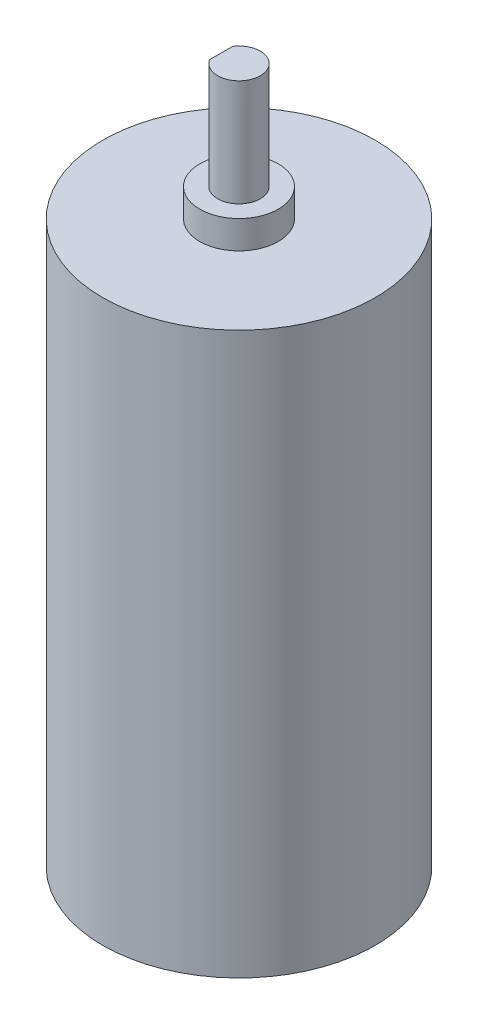
ISO-10303-21;
HEADER;
FILE_DESCRIPTION(('STEP AP214'),'2;1');
FILE_NAME('part.step','',(''),(''),'','','');
FILE_SCHEMA(('AUTOMOTIVE_DESIGN { 1 0 10303 214 1 1 1 1 }'));
ENDSEC;
DATA;
#1=APPLICATION_CONTEXT('core data for automotive mechanical design processes');
#2=APPLICATION_PROTOCOL_DEFINITION('international standard','automotive_design',2000,#1);
#3=PRODUCT_CONTEXT('',#1,'mechanical');
#4=PRODUCT('Part','Part','',(#3));
#5=PRODUCT_RELATED_PRODUCT_CATEGORY('part','',(#4));
#6=PRODUCT_DEFINITION_FORMATION('','',#4);
#7=PRODUCT_DEFINITION_CONTEXT('part definition',#1,'design');
#8=PRODUCT_DEFINITION('design','',#6,#7);
#9=PRODUCT_DEFINITION_SHAPE('','',#8);
#10=(LENGTH_UNIT() NAMED_UNIT(*) SI_UNIT(.MILLI.,.METRE.));
#11=(NAMED_UNIT(*) PLANE_ANGLE_UNIT() SI_UNIT($,.RADIAN.));
#12=(NAMED_UNIT(*) SI_UNIT($,.STERADIAN.) SOLID_ANGLE_UNIT());
#13=UNCERTAINTY_MEASURE_WITH_UNIT(LENGTH_MEASURE(1.E-05),#10,'distance_accuracy_value','');
#14=(GEOMETRIC_REPRESENTATION_CONTEXT(3) GLOBAL_UNCERTAINTY_ASSIGNED_CONTEXT((#13)) GLOBAL_UNIT_ASSIGNED_CONTEXT((#10,
#11,#12)) REPRESENTATION_CONTEXT('',''));
#15=CARTESIAN_POINT('',(0.,0.,0.));
#16=DIRECTION('',(0.,0.,1.));
#17=DIRECTION('',(1.,0.,0.));
#18=AXIS2_PLACEMENT_3D('',#15,#16,#17);
#19=CARTESIAN_POINT('',(0.,52.5,0.));
#20=DIRECTION('',(0.,1.,0.));
#21=DIRECTION('',(0.,0.,1.));
#22=AXIS2_PLACEMENT_3D('',#19,#20,#21);
#23=PLANE('',#22);
#24=CARTESIAN_POINT('',(0.,52.5,0.));
#25=DIRECTION('',(0.,1.,0.));
#26=DIRECTION('',(0.,0.,1.));
#27=AXIS2_PLACEMENT_3D('',#24,#25,#26);
#28=CIRCLE('',#27,3.5);
#29=CARTESIAN_POINT('',(0.,52.5,3.5));
#30=VERTEX_POINT('',#29);
#31=EDGE_CURVE('E86',#30,#30,#28,.T.);
#32=ORIENTED_EDGE('',*,*,#31,.T.);
#33=EDGE_LOOP('',(#32));
#34=FACE_BOUND('',#33,.T.);
#35=CARTESIAN_POINT('',(0.,52.5,0.));
#36=DIRECTION('',(0.,1.,0.));
#37=DIRECTION('',(0.,0.,1.));
#38=AXIS2_PLACEMENT_3D('',#35,#36,#37);
#39=CIRCLE('',#38,1.90137947355038);
#40=CARTESIAN_POINT('',(0.,52.5,1.90137947355038));
#41=VERTEX_POINT('',#40);
#42=EDGE_CURVE('E82',#41,#41,#39,.T.);
#43=ORIENTED_EDGE('',*,*,#42,.F.);
#44=EDGE_LOOP('',(#43));
#45=FACE_BOUND('',#44,.T.);
#46=ADVANCED_FACE('F44',(#34,#45),#23,.T.);
#47=CARTESIAN_POINT('',(0.,50.,0.));
#48=DIRECTION('',(0.,-1.,0.));
#49=DIRECTION('',(0.,0.,-1.));
#50=AXIS2_PLACEMENT_3D('',#47,#48,#49);
#51=CYLINDRICAL_SURFACE('',#50,12.15);
#52=CARTESIAN_POINT('',(0.,50.,0.));
#53=DIRECTION('',(0.,1.,0.));
#54=DIRECTION('',(0.,0.,1.));
#55=AXIS2_PLACEMENT_3D('',#52,#53,#54);
#56=CIRCLE('',#55,12.15);
#57=CARTESIAN_POINT('',(0.,50.,12.15));
#58=VERTEX_POINT('',#57);
#59=EDGE_CURVE('E99',#58,#58,#56,.T.);
#60=ORIENTED_EDGE('',*,*,#59,.F.);
#61=EDGE_LOOP('',(#60));
#62=FACE_BOUND('',#61,.T.);
#63=CARTESIAN_POINT('',(0.,0.,0.));
#64=DIRECTION('',(0.,1.,0.));
#65=DIRECTION('',(0.,0.,1.));
#66=AXIS2_PLACEMENT_3D('',#63,#64,#65);
#67=CIRCLE('',#66,12.15);
#68=CARTESIAN_POINT('',(0.,0.,12.15));
#69=VERTEX_POINT('',#68);
#70=EDGE_CURVE('E91',#69,#69,#67,.T.);
#71=ORIENTED_EDGE('',*,*,#70,.T.);
#72=EDGE_LOOP('',(#71));
#73=FACE_BOUND('',#72,.T.);
#74=ADVANCED_FACE('F46',(#62,#73),#51,.T.);
#75=CARTESIAN_POINT('',(0.,50.,0.));
#76=DIRECTION('',(0.,1.,0.));
#77=DIRECTION('',(0.,0.,1.));
#78=AXIS2_PLACEMENT_3D('',#75,#76,#77);
#79=PLANE('',#78);
#80=CARTESIAN_POINT('',(0.,50.,0.));
#81=DIRECTION('',(0.,1.,0.));
#82=DIRECTION('',(0.,0.,1.));
#83=AXIS2_PLACEMENT_3D('',#80,#81,#82);
#84=CIRCLE('',#83,3.5);
#85=CARTESIAN_POINT('',(0.,50.,3.5));
#86=VERTEX_POINT('',#85);
#87=EDGE_CURVE('E53',#86,#86,#84,.T.);
#88=ORIENTED_EDGE('',*,*,#87,.F.);
#89=EDGE_LOOP('',(#88));
#90=FACE_BOUND('',#89,.T.);
#91=ORIENTED_EDGE('',*,*,#59,.T.);
#92=EDGE_LOOP('',(#91));
#93=FACE_BOUND('',#92,.T.);
#94=ADVANCED_FACE('F110',(#90,#93),#79,.T.);
#95=CARTESIAN_POINT('',(0.,0.,0.));
#96=DIRECTION('',(0.,1.,0.));
#97=DIRECTION('',(0.,0.,1.));
#98=AXIS2_PLACEMENT_3D('',#95,#96,#97);
#99=PLANE('',#98);
#100=ORIENTED_EDGE('',*,*,#70,.F.);
#101=EDGE_LOOP('',(#100));
#102=FACE_BOUND('',#101,.T.);
#103=ADVANCED_FACE('F107',(#102),#99,.F.);
#104=CARTESIAN_POINT('',(0.,52.5,0.));
#105=DIRECTION('',(0.,-1.,0.));
#106=DIRECTION('',(0.,0.,-1.));
#107=AXIS2_PLACEMENT_3D('',#104,#105,#106);
#108=CYLINDRICAL_SURFACE('',#107,3.5);
#109=ORIENTED_EDGE('',*,*,#31,.F.);
#110=EDGE_LOOP('',(#109));
#111=FACE_BOUND('',#110,.T.);
#112=ORIENTED_EDGE('',*,*,#87,.T.);
#113=EDGE_LOOP('',(#112));
#114=FACE_BOUND('',#113,.T.);
#115=ADVANCED_FACE('F109',(#111,#114),#108,.T.);
#116=CARTESIAN_POINT('',(0.,62.,0.));
#117=DIRECTION('',(0.,-1.,0.));
#118=DIRECTION('',(0.,0.,-1.));
#119=AXIS2_PLACEMENT_3D('',#116,#117,#118);
#120=CYLINDRICAL_SURFACE('',#119,1.90137947355038);
#121=DIRECTION('',(0.,-1.,0.));
#122=VECTOR('',#121,1.);
#123=CARTESIAN_POINT('',(-1.59862052644962,62.,1.02939609230492));
#124=LINE('',#123,#122);
#125=CARTESIAN_POINT('',(-1.59862052644962,62.,1.02939609230492));
#126=VERTEX_POINT('',#125);
#127=CARTESIAN_POINT('',(-1.59862052644962,54.,1.02939609230492));
#128=VERTEX_POINT('',#127);
#129=EDGE_CURVE('E80',#126,#128,#124,.T.);
#130=ORIENTED_EDGE('',*,*,#129,.T.);
#131=CARTESIAN_POINT('',(0.,54.,0.));
#132=DIRECTION('',(0.,1.,0.));
#133=DIRECTION('',(0.,0.,1.));
#134=AXIS2_PLACEMENT_3D('',#131,#132,#133);
#135=CIRCLE('',#134,1.90137947355038);
#136=CARTESIAN_POINT('',(-1.59862052644962,54.,-1.02939609230492));
#137=VERTEX_POINT('',#136);
#138=EDGE_CURVE('E59',#137,#128,#135,.T.);
#139=ORIENTED_EDGE('',*,*,#138,.F.);
#140=DIRECTION('',(0.,-1.,0.));
#141=VECTOR('',#140,1.);
#142=CARTESIAN_POINT('',(-1.59862052644962,62.,-1.02939609230492));
#143=LINE('',#142,#141);
#144=CARTESIAN_POINT('',(-1.59862052644962,62.,-1.02939609230492));
#145=VERTEX_POINT('',#144);
#146=EDGE_CURVE('E79',#145,#137,#143,.T.);
#147=ORIENTED_EDGE('',*,*,#146,.F.);
#148=CARTESIAN_POINT('',(0.,62.,0.));
#149=DIRECTION('',(0.,1.,0.));
#150=DIRECTION('',(0.,0.,1.));
#151=AXIS2_PLACEMENT_3D('',#148,#149,#150);
#152=CIRCLE('',#151,1.90137947355038);
#153=EDGE_CURVE('E209',#126,#145,#152,.T.);
#154=ORIENTED_EDGE('',*,*,#153,.F.);
#155=EDGE_LOOP('',(#130,#139,#147,#154));
#156=FACE_BOUND('',#155,.T.);
#157=ORIENTED_EDGE('',*,*,#42,.T.);
#158=EDGE_LOOP('',(#157));
#159=FACE_BOUND('',#158,.T.);
#160=ADVANCED_FACE('F76',(#156,#159),#120,.T.);
#161=CARTESIAN_POINT('',(-1.59862052644962,62.,-1.02939609230492));
#162=DIRECTION('',(1.,0.,0.));
#163=DIRECTION('',(0.,0.,-1.));
#164=AXIS2_PLACEMENT_3D('',#161,#162,#163);
#165=PLANE('',#164);
#166=ORIENTED_EDGE('',*,*,#146,.T.);
#167=DIRECTION('',(0.,0.,1.));
#168=VECTOR('',#167,1.);
#169=CARTESIAN_POINT('',(-1.59862052644962,54.,-1.02939609230492));
#170=LINE('',#169,#168);
#171=EDGE_CURVE('E11',#137,#128,#170,.T.);
#172=ORIENTED_EDGE('',*,*,#171,.T.);
#173=ORIENTED_EDGE('',*,*,#129,.F.);
#174=DIRECTION('',(0.,0.,1.));
#175=VECTOR('',#174,1.);
#176=CARTESIAN_POINT('',(-1.59862052644962,62.,-1.02939609230492));
#177=LINE('',#176,#175);
#178=EDGE_CURVE('E65',#145,#126,#177,.T.);
#179=ORIENTED_EDGE('',*,*,#178,.F.);
#180=EDGE_LOOP('',(#166,#172,#173,#179));
#181=FACE_BOUND('',#180,.T.);
#182=ADVANCED_FACE('F84',(#181),#165,.F.);
#183=CARTESIAN_POINT('',(0.,62.,0.));
#184=DIRECTION('',(0.,1.,0.));
#185=DIRECTION('',(0.,0.,1.));
#186=AXIS2_PLACEMENT_3D('',#183,#184,#185);
#187=PLANE('',#186);
#188=ORIENTED_EDGE('',*,*,#153,.T.);
#189=ORIENTED_EDGE('',*,*,#178,.T.);
#190=EDGE_LOOP('',(#188,#189));
#191=FACE_BOUND('',#190,.T.);
#192=ADVANCED_FACE('F132',(#191),#187,.T.);
#193=CARTESIAN_POINT('',(0.,54.,0.));
#194=DIRECTION('',(0.,1.,0.));
#195=DIRECTION('',(0.,0.,1.));
#196=AXIS2_PLACEMENT_3D('',#193,#194,#195);
#197=PLANE('',#196);
#198=ORIENTED_EDGE('',*,*,#171,.F.);
#199=ORIENTED_EDGE('',*,*,#138,.T.);
#200=EDGE_LOOP('',(#198,#199));
#201=FACE_BOUND('',#200,.T.);
#202=ADVANCED_FACE('F70',(#201),#197,.T.);
#203=CLOSED_SHELL('',(#46,#74,#94,#103,#115,#160,#182,#192,#202));
#204=MANIFOLD_SOLID_BREP('B2',#203);
#205=ADVANCED_BREP_SHAPE_REPRESENTATION('',(#18,#204),#14);
#206=SHAPE_DEFINITION_REPRESENTATION(#9,#205);
ENDSEC;
END-ISO-10303-21;
